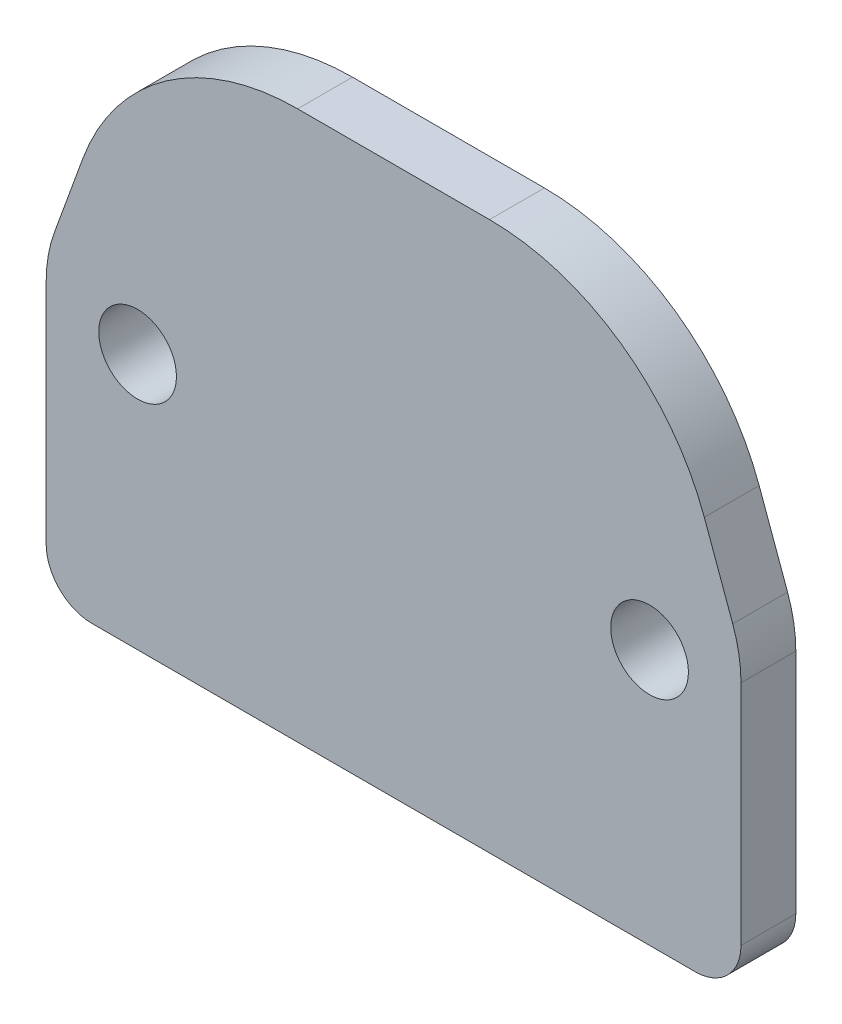
ISO-10303-21;
HEADER;
FILE_DESCRIPTION(('STEP AP214'),'2;1');
FILE_NAME('part.step','',(''),(''),'','','');
FILE_SCHEMA(('AUTOMOTIVE_DESIGN { 1 0 10303 214 1 1 1 1 }'));
ENDSEC;
DATA;
#1=APPLICATION_CONTEXT('core data for automotive mechanical design processes');
#2=APPLICATION_PROTOCOL_DEFINITION('international standard','automotive_design',2000,#1);
#3=PRODUCT_CONTEXT('',#1,'mechanical');
#4=PRODUCT('Part','Part','',(#3));
#5=PRODUCT_RELATED_PRODUCT_CATEGORY('part','',(#4));
#6=PRODUCT_DEFINITION_FORMATION('','',#4);
#7=PRODUCT_DEFINITION_CONTEXT('part definition',#1,'design');
#8=PRODUCT_DEFINITION('design','',#6,#7);
#9=PRODUCT_DEFINITION_SHAPE('','',#8);
#10=(LENGTH_UNIT() NAMED_UNIT(*) SI_UNIT(.MILLI.,.METRE.));
#11=(NAMED_UNIT(*) PLANE_ANGLE_UNIT() SI_UNIT($,.RADIAN.));
#12=(NAMED_UNIT(*) SI_UNIT($,.STERADIAN.) SOLID_ANGLE_UNIT());
#13=UNCERTAINTY_MEASURE_WITH_UNIT(LENGTH_MEASURE(1.E-05),#10,'distance_accuracy_value','');
#14=(GEOMETRIC_REPRESENTATION_CONTEXT(3) GLOBAL_UNCERTAINTY_ASSIGNED_CONTEXT((#13)) GLOBAL_UNIT_ASSIGNED_CONTEXT((#10,
#11,#12)) REPRESENTATION_CONTEXT('',''));
#15=CARTESIAN_POINT('',(0.,0.,0.));
#16=DIRECTION('',(0.,0.,1.));
#17=DIRECTION('',(1.,0.,0.));
#18=AXIS2_PLACEMENT_3D('',#15,#16,#17);
#19=CARTESIAN_POINT('',(33.,-55.,6.));
#20=DIRECTION('',(0.,0.,1.));
#21=DIRECTION('',(1.,0.,0.));
#22=AXIS2_PLACEMENT_3D('',#19,#20,#21);
#23=PLANE('',#22);
#24=CARTESIAN_POINT('',(-28.,-32.,6.));
#25=DIRECTION('',(0.,0.,1.));
#26=DIRECTION('',(1.,0.,0.));
#27=AXIS2_PLACEMENT_3D('',#24,#25,#26);
#28=CIRCLE('',#27,4.25);
#29=CARTESIAN_POINT('',(-23.75,-32.,6.));
#30=VERTEX_POINT('',#29);
#31=EDGE_CURVE('E170',#30,#30,#28,.T.);
#32=ORIENTED_EDGE('',*,*,#31,.F.);
#33=EDGE_LOOP('',(#32));
#34=FACE_BOUND('',#33,.T.);
#35=CARTESIAN_POINT('',(33.,-55.,6.));
#36=DIRECTION('',(0.,0.,1.));
#37=DIRECTION('',(1.,0.,0.));
#38=AXIS2_PLACEMENT_3D('',#35,#36,#37);
#39=CIRCLE('',#38,4.99999999999999);
#40=CARTESIAN_POINT('',(33.,-60.,6.));
#41=VERTEX_POINT('',#40);
#42=CARTESIAN_POINT('',(38.,-55.,6.));
#43=VERTEX_POINT('',#42);
#44=EDGE_CURVE('E189',#41,#43,#39,.T.);
#45=ORIENTED_EDGE('',*,*,#44,.T.);
#46=DIRECTION('',(0.,1.,0.));
#47=VECTOR('',#46,1.);
#48=CARTESIAN_POINT('',(38.,-55.,6.));
#49=LINE('',#48,#47);
#50=CARTESIAN_POINT('',(38.,-30.1196789051737,6.));
#51=VERTEX_POINT('',#50);
#52=EDGE_CURVE('E117',#43,#51,#49,.T.);
#53=ORIENTED_EDGE('',*,*,#52,.T.);
#54=CARTESIAN_POINT('',(23.,-30.1196789051736,6.));
#55=DIRECTION('',(0.,0.,1.));
#56=DIRECTION('',(1.,0.,0.));
#57=AXIS2_PLACEMENT_3D('',#54,#55,#56);
#58=CIRCLE('',#57,15.);
#59=CARTESIAN_POINT('',(37.0953893117887,-24.9893767552888,6.));
#60=VERTEX_POINT('',#59);
#61=EDGE_CURVE('E216',#51,#60,#58,.T.);
#62=ORIENTED_EDGE('',*,*,#61,.T.);
#63=DIRECTION('',(-0.342020143325664,0.93969262078591,0.));
#64=VECTOR('',#63,1.);
#65=CARTESIAN_POINT('',(37.0953893117887,-24.9893767552888,6.));
#66=LINE('',#65,#64);
#67=CARTESIAN_POINT('',(33.9871270644049,-16.4494964168584,6.));
#68=VERTEX_POINT('',#67);
#69=EDGE_CURVE('E235',#60,#68,#66,.T.);
#70=ORIENTED_EDGE('',*,*,#69,.T.);
#71=CARTESIAN_POINT('',(10.4948115447572,-25.,6.));
#72=DIRECTION('',(0.,0.,1.));
#73=DIRECTION('',(1.,0.,0.));
#74=AXIS2_PLACEMENT_3D('',#71,#72,#73);
#75=CIRCLE('',#74,25.);
#76=CARTESIAN_POINT('',(10.4948115447572,0.,6.));
#77=VERTEX_POINT('',#76);
#78=EDGE_CURVE('E232',#68,#77,#75,.T.);
#79=ORIENTED_EDGE('',*,*,#78,.T.);
#80=DIRECTION('',(-1.,0.,0.));
#81=VECTOR('',#80,1.);
#82=CARTESIAN_POINT('',(10.4948115447572,0.,6.));
#83=LINE('',#82,#81);
#84=CARTESIAN_POINT('',(-10.4948115447572,0.,6.));
#85=VERTEX_POINT('',#84);
#86=EDGE_CURVE('E234',#77,#85,#83,.T.);
#87=ORIENTED_EDGE('',*,*,#86,.T.);
#88=CARTESIAN_POINT('',(-10.4948115447572,-25.,6.));
#89=DIRECTION('',(0.,0.,1.));
#90=DIRECTION('',(1.,0.,0.));
#91=AXIS2_PLACEMENT_3D('',#88,#89,#90);
#92=CIRCLE('',#91,25.);
#93=CARTESIAN_POINT('',(-33.9871270644049,-16.4494964168584,6.));
#94=VERTEX_POINT('',#93);
#95=EDGE_CURVE('E237',#85,#94,#92,.T.);
#96=ORIENTED_EDGE('',*,*,#95,.T.);
#97=DIRECTION('',(-0.342020143325661,-0.939692620785911,0.));
#98=VECTOR('',#97,1.);
#99=CARTESIAN_POINT('',(-33.9871270644049,-16.4494964168584,6.));
#100=LINE('',#99,#98);
#101=CARTESIAN_POINT('',(-37.0953893117887,-24.9893767552888,6.));
#102=VERTEX_POINT('',#101);
#103=EDGE_CURVE('E243',#94,#102,#100,.T.);
#104=ORIENTED_EDGE('',*,*,#103,.T.);
#105=CARTESIAN_POINT('',(-23.,-30.1196789051736,6.));
#106=DIRECTION('',(0.,0.,1.));
#107=DIRECTION('',(1.,0.,0.));
#108=AXIS2_PLACEMENT_3D('',#105,#106,#107);
#109=CIRCLE('',#108,15.);
#110=CARTESIAN_POINT('',(-38.,-30.1196789051737,6.));
#111=VERTEX_POINT('',#110);
#112=EDGE_CURVE('E148',#102,#111,#109,.T.);
#113=ORIENTED_EDGE('',*,*,#112,.T.);
#114=DIRECTION('',(0.,-1.,0.));
#115=VECTOR('',#114,1.);
#116=CARTESIAN_POINT('',(-38.,-30.1196789051737,6.));
#117=LINE('',#116,#115);
#118=CARTESIAN_POINT('',(-38.,-55.,6.));
#119=VERTEX_POINT('',#118);
#120=EDGE_CURVE('E142',#111,#119,#117,.T.);
#121=ORIENTED_EDGE('',*,*,#120,.T.);
#122=CARTESIAN_POINT('',(-33.,-55.,6.));
#123=DIRECTION('',(0.,0.,1.));
#124=DIRECTION('',(1.,0.,0.));
#125=AXIS2_PLACEMENT_3D('',#122,#123,#124);
#126=CIRCLE('',#125,4.99999999999999);
#127=CARTESIAN_POINT('',(-33.,-60.,6.));
#128=VERTEX_POINT('',#127);
#129=EDGE_CURVE('E146',#119,#128,#126,.T.);
#130=ORIENTED_EDGE('',*,*,#129,.T.);
#131=DIRECTION('',(1.,0.,0.));
#132=VECTOR('',#131,1.);
#133=CARTESIAN_POINT('',(-33.,-60.,6.));
#134=LINE('',#133,#132);
#135=EDGE_CURVE('E62',#128,#41,#134,.T.);
#136=ORIENTED_EDGE('',*,*,#135,.T.);
#137=EDGE_LOOP('',(#45,#53,#62,#70,#79,#87,#96,#104,#113,#121,#130,#136));
#138=FACE_BOUND('',#137,.T.);
#139=CARTESIAN_POINT('',(28.,-32.,6.));
#140=DIRECTION('',(0.,0.,1.));
#141=DIRECTION('',(1.,0.,0.));
#142=AXIS2_PLACEMENT_3D('',#139,#140,#141);
#143=CIRCLE('',#142,4.25);
#144=CARTESIAN_POINT('',(32.25,-32.,6.));
#145=VERTEX_POINT('',#144);
#146=EDGE_CURVE('E286',#145,#145,#143,.T.);
#147=ORIENTED_EDGE('',*,*,#146,.F.);
#148=EDGE_LOOP('',(#147));
#149=FACE_BOUND('',#148,.T.);
#150=ADVANCED_FACE('F45',(#34,#138,#149),#23,.T.);
#151=CARTESIAN_POINT('',(33.,-55.,0.));
#152=DIRECTION('',(0.,0.,1.));
#153=DIRECTION('',(1.,0.,0.));
#154=AXIS2_PLACEMENT_3D('',#151,#152,#153);
#155=PLANE('',#154);
#156=CARTESIAN_POINT('',(-28.,-32.,0.));
#157=DIRECTION('',(0.,0.,1.));
#158=DIRECTION('',(1.,0.,0.));
#159=AXIS2_PLACEMENT_3D('',#156,#157,#158);
#160=CIRCLE('',#159,4.25);
#161=CARTESIAN_POINT('',(-23.75,-32.,0.));
#162=VERTEX_POINT('',#161);
#163=EDGE_CURVE('E291',#162,#162,#160,.T.);
#164=ORIENTED_EDGE('',*,*,#163,.T.);
#165=EDGE_LOOP('',(#164));
#166=FACE_BOUND('',#165,.T.);
#167=CARTESIAN_POINT('',(33.,-55.,0.));
#168=DIRECTION('',(0.,0.,1.));
#169=DIRECTION('',(1.,0.,0.));
#170=AXIS2_PLACEMENT_3D('',#167,#168,#169);
#171=CIRCLE('',#170,4.99999999999999);
#172=CARTESIAN_POINT('',(33.,-60.,0.));
#173=VERTEX_POINT('',#172);
#174=CARTESIAN_POINT('',(38.,-55.,0.));
#175=VERTEX_POINT('',#174);
#176=EDGE_CURVE('E166',#173,#175,#171,.T.);
#177=ORIENTED_EDGE('',*,*,#176,.F.);
#178=DIRECTION('',(1.,0.,0.));
#179=VECTOR('',#178,1.);
#180=CARTESIAN_POINT('',(-33.,-60.,0.));
#181=LINE('',#180,#179);
#182=CARTESIAN_POINT('',(-33.,-60.,0.));
#183=VERTEX_POINT('',#182);
#184=EDGE_CURVE('E109',#183,#173,#181,.T.);
#185=ORIENTED_EDGE('',*,*,#184,.F.);
#186=CARTESIAN_POINT('',(-33.,-55.,0.));
#187=DIRECTION('',(0.,0.,1.));
#188=DIRECTION('',(1.,0.,0.));
#189=AXIS2_PLACEMENT_3D('',#186,#187,#188);
#190=CIRCLE('',#189,4.99999999999999);
#191=CARTESIAN_POINT('',(-38.,-55.,0.));
#192=VERTEX_POINT('',#191);
#193=EDGE_CURVE('E103',#192,#183,#190,.T.);
#194=ORIENTED_EDGE('',*,*,#193,.F.);
#195=DIRECTION('',(0.,-1.,0.));
#196=VECTOR('',#195,1.);
#197=CARTESIAN_POINT('',(-38.,-30.1196789051737,0.));
#198=LINE('',#197,#196);
#199=CARTESIAN_POINT('',(-38.,-30.1196789051737,0.));
#200=VERTEX_POINT('',#199);
#201=EDGE_CURVE('E156',#200,#192,#198,.T.);
#202=ORIENTED_EDGE('',*,*,#201,.F.);
#203=CARTESIAN_POINT('',(-23.,-30.1196789051736,0.));
#204=DIRECTION('',(0.,0.,1.));
#205=DIRECTION('',(1.,0.,0.));
#206=AXIS2_PLACEMENT_3D('',#203,#204,#205);
#207=CIRCLE('',#206,15.);
#208=CARTESIAN_POINT('',(-37.0953893117887,-24.9893767552888,0.));
#209=VERTEX_POINT('',#208);
#210=EDGE_CURVE('E184',#209,#200,#207,.T.);
#211=ORIENTED_EDGE('',*,*,#210,.F.);
#212=DIRECTION('',(-0.342020143325661,-0.939692620785911,0.));
#213=VECTOR('',#212,1.);
#214=CARTESIAN_POINT('',(-33.9871270644049,-16.4494964168584,0.));
#215=LINE('',#214,#213);
#216=CARTESIAN_POINT('',(-33.9871270644049,-16.4494964168584,0.));
#217=VERTEX_POINT('',#216);
#218=EDGE_CURVE('E182',#217,#209,#215,.T.);
#219=ORIENTED_EDGE('',*,*,#218,.F.);
#220=CARTESIAN_POINT('',(-10.4948115447572,-25.,0.));
#221=DIRECTION('',(0.,0.,1.));
#222=DIRECTION('',(1.,0.,0.));
#223=AXIS2_PLACEMENT_3D('',#220,#221,#222);
#224=CIRCLE('',#223,25.);
#225=CARTESIAN_POINT('',(-10.4948115447572,0.,0.));
#226=VERTEX_POINT('',#225);
#227=EDGE_CURVE('E180',#226,#217,#224,.T.);
#228=ORIENTED_EDGE('',*,*,#227,.F.);
#229=DIRECTION('',(-1.,0.,0.));
#230=VECTOR('',#229,1.);
#231=CARTESIAN_POINT('',(10.4948115447572,0.,0.));
#232=LINE('',#231,#230);
#233=CARTESIAN_POINT('',(10.4948115447572,0.,0.));
#234=VERTEX_POINT('',#233);
#235=EDGE_CURVE('E178',#234,#226,#232,.T.);
#236=ORIENTED_EDGE('',*,*,#235,.F.);
#237=CARTESIAN_POINT('',(10.4948115447572,-25.,0.));
#238=DIRECTION('',(0.,0.,1.));
#239=DIRECTION('',(1.,0.,0.));
#240=AXIS2_PLACEMENT_3D('',#237,#238,#239);
#241=CIRCLE('',#240,25.);
#242=CARTESIAN_POINT('',(33.9871270644049,-16.4494964168584,0.));
#243=VERTEX_POINT('',#242);
#244=EDGE_CURVE('E176',#243,#234,#241,.T.);
#245=ORIENTED_EDGE('',*,*,#244,.F.);
#246=DIRECTION('',(-0.342020143325664,0.93969262078591,0.));
#247=VECTOR('',#246,1.);
#248=CARTESIAN_POINT('',(37.0953893117887,-24.9893767552888,0.));
#249=LINE('',#248,#247);
#250=CARTESIAN_POINT('',(37.0953893117887,-24.9893767552888,0.));
#251=VERTEX_POINT('',#250);
#252=EDGE_CURVE('E174',#251,#243,#249,.T.);
#253=ORIENTED_EDGE('',*,*,#252,.F.);
#254=CARTESIAN_POINT('',(23.,-30.1196789051736,0.));
#255=DIRECTION('',(0.,0.,1.));
#256=DIRECTION('',(1.,0.,0.));
#257=AXIS2_PLACEMENT_3D('',#254,#255,#256);
#258=CIRCLE('',#257,15.);
#259=CARTESIAN_POINT('',(38.,-30.1196789051737,0.));
#260=VERTEX_POINT('',#259);
#261=EDGE_CURVE('E172',#260,#251,#258,.T.);
#262=ORIENTED_EDGE('',*,*,#261,.F.);
#263=DIRECTION('',(0.,1.,0.));
#264=VECTOR('',#263,1.);
#265=CARTESIAN_POINT('',(38.,-55.,0.));
#266=LINE('',#265,#264);
#267=EDGE_CURVE('E169',#175,#260,#266,.T.);
#268=ORIENTED_EDGE('',*,*,#267,.F.);
#269=EDGE_LOOP('',(#177,#185,#194,#202,#211,#219,#228,#236,#245,#253,#262,#268));
#270=FACE_BOUND('',#269,.T.);
#271=CARTESIAN_POINT('',(28.,-32.,0.));
#272=DIRECTION('',(0.,0.,1.));
#273=DIRECTION('',(1.,0.,0.));
#274=AXIS2_PLACEMENT_3D('',#271,#272,#273);
#275=CIRCLE('',#274,4.25);
#276=CARTESIAN_POINT('',(32.25,-32.,0.));
#277=VERTEX_POINT('',#276);
#278=EDGE_CURVE('E289',#277,#277,#275,.T.);
#279=ORIENTED_EDGE('',*,*,#278,.T.);
#280=EDGE_LOOP('',(#279));
#281=FACE_BOUND('',#280,.T.);
#282=ADVANCED_FACE('F220',(#166,#270,#281),#155,.F.);
#283=CARTESIAN_POINT('',(33.,-55.,6.));
#284=DIRECTION('',(0.,0.,-1.));
#285=DIRECTION('',(-1.,0.,0.));
#286=AXIS2_PLACEMENT_3D('',#283,#284,#285);
#287=CYLINDRICAL_SURFACE('',#286,4.99999999999999);
#288=ORIENTED_EDGE('',*,*,#176,.T.);
#289=DIRECTION('',(0.,0.,-1.));
#290=VECTOR('',#289,1.);
#291=CARTESIAN_POINT('',(38.,-55.,6.));
#292=LINE('',#291,#290);
#293=EDGE_CURVE('E11',#43,#175,#292,.T.);
#294=ORIENTED_EDGE('',*,*,#293,.F.);
#295=ORIENTED_EDGE('',*,*,#44,.F.);
#296=DIRECTION('',(0.,0.,-1.));
#297=VECTOR('',#296,1.);
#298=CARTESIAN_POINT('',(33.,-60.,6.));
#299=LINE('',#298,#297);
#300=EDGE_CURVE('E162',#41,#173,#299,.T.);
#301=ORIENTED_EDGE('',*,*,#300,.T.);
#302=EDGE_LOOP('',(#288,#294,#295,#301));
#303=FACE_BOUND('',#302,.T.);
#304=ADVANCED_FACE('F47',(#303),#287,.T.);
#305=CARTESIAN_POINT('',(38.,-55.,6.));
#306=DIRECTION('',(-1.,0.,0.));
#307=DIRECTION('',(0.,-1.,0.));
#308=AXIS2_PLACEMENT_3D('',#305,#306,#307);
#309=PLANE('',#308);
#310=ORIENTED_EDGE('',*,*,#267,.T.);
#311=DIRECTION('',(0.,0.,-1.));
#312=VECTOR('',#311,1.);
#313=CARTESIAN_POINT('',(38.,-30.1196789051737,6.));
#314=LINE('',#313,#312);
#315=EDGE_CURVE('E54',#51,#260,#314,.T.);
#316=ORIENTED_EDGE('',*,*,#315,.F.);
#317=ORIENTED_EDGE('',*,*,#52,.F.);
#318=ORIENTED_EDGE('',*,*,#293,.T.);
#319=EDGE_LOOP('',(#310,#316,#317,#318));
#320=FACE_BOUND('',#319,.T.);
#321=ADVANCED_FACE('F364',(#320),#309,.F.);
#322=CARTESIAN_POINT('',(23.,-30.1196789051736,6.));
#323=DIRECTION('',(0.,0.,-1.));
#324=DIRECTION('',(-1.,0.,0.));
#325=AXIS2_PLACEMENT_3D('',#322,#323,#324);
#326=CYLINDRICAL_SURFACE('',#325,15.);
#327=ORIENTED_EDGE('',*,*,#261,.T.);
#328=DIRECTION('',(0.,0.,-1.));
#329=VECTOR('',#328,1.);
#330=CARTESIAN_POINT('',(37.0953893117887,-24.9893767552888,6.));
#331=LINE('',#330,#329);
#332=EDGE_CURVE('E208',#60,#251,#331,.T.);
#333=ORIENTED_EDGE('',*,*,#332,.F.);
#334=ORIENTED_EDGE('',*,*,#61,.F.);
#335=ORIENTED_EDGE('',*,*,#315,.T.);
#336=EDGE_LOOP('',(#327,#333,#334,#335));
#337=FACE_BOUND('',#336,.T.);
#338=ADVANCED_FACE('F214',(#337),#326,.T.);
#339=CARTESIAN_POINT('',(37.0953893117887,-24.9893767552888,6.));
#340=DIRECTION('',(-0.93969262078591,-0.342020143325664,0.));
#341=DIRECTION('',(0.342020143325664,-0.93969262078591,0.));
#342=AXIS2_PLACEMENT_3D('',#339,#340,#341);
#343=PLANE('',#342);
#344=ORIENTED_EDGE('',*,*,#252,.T.);
#345=DIRECTION('',(0.,0.,-1.));
#346=VECTOR('',#345,1.);
#347=CARTESIAN_POINT('',(33.9871270644049,-16.4494964168584,6.));
#348=LINE('',#347,#346);
#349=EDGE_CURVE('E205',#68,#243,#348,.T.);
#350=ORIENTED_EDGE('',*,*,#349,.F.);
#351=ORIENTED_EDGE('',*,*,#69,.F.);
#352=ORIENTED_EDGE('',*,*,#332,.T.);
#353=EDGE_LOOP('',(#344,#350,#351,#352));
#354=FACE_BOUND('',#353,.T.);
#355=ADVANCED_FACE('F226',(#354),#343,.F.);
#356=CARTESIAN_POINT('',(10.4948115447572,-25.,6.));
#357=DIRECTION('',(0.,0.,-1.));
#358=DIRECTION('',(-1.,0.,0.));
#359=AXIS2_PLACEMENT_3D('',#356,#357,#358);
#360=CYLINDRICAL_SURFACE('',#359,25.);
#361=ORIENTED_EDGE('',*,*,#244,.T.);
#362=DIRECTION('',(0.,0.,-1.));
#363=VECTOR('',#362,1.);
#364=CARTESIAN_POINT('',(10.4948115447572,0.,6.));
#365=LINE('',#364,#363);
#366=EDGE_CURVE('E202',#77,#234,#365,.T.);
#367=ORIENTED_EDGE('',*,*,#366,.F.);
#368=ORIENTED_EDGE('',*,*,#78,.F.);
#369=ORIENTED_EDGE('',*,*,#349,.T.);
#370=EDGE_LOOP('',(#361,#367,#368,#369));
#371=FACE_BOUND('',#370,.T.);
#372=ADVANCED_FACE('F230',(#371),#360,.T.);
#373=CARTESIAN_POINT('',(10.4948115447572,0.,6.));
#374=DIRECTION('',(0.,-1.,0.));
#375=DIRECTION('',(0.,0.,-1.));
#376=AXIS2_PLACEMENT_3D('',#373,#374,#375);
#377=PLANE('',#376);
#378=ORIENTED_EDGE('',*,*,#235,.T.);
#379=DIRECTION('',(0.,0.,-1.));
#380=VECTOR('',#379,1.);
#381=CARTESIAN_POINT('',(-10.4948115447572,0.,6.));
#382=LINE('',#381,#380);
#383=EDGE_CURVE('E199',#85,#226,#382,.T.);
#384=ORIENTED_EDGE('',*,*,#383,.F.);
#385=ORIENTED_EDGE('',*,*,#86,.F.);
#386=ORIENTED_EDGE('',*,*,#366,.T.);
#387=EDGE_LOOP('',(#378,#384,#385,#386));
#388=FACE_BOUND('',#387,.T.);
#389=ADVANCED_FACE('F337',(#388),#377,.F.);
#390=CARTESIAN_POINT('',(-10.4948115447572,-25.,6.));
#391=DIRECTION('',(0.,0.,-1.));
#392=DIRECTION('',(-1.,0.,0.));
#393=AXIS2_PLACEMENT_3D('',#390,#391,#392);
#394=CYLINDRICAL_SURFACE('',#393,25.);
#395=ORIENTED_EDGE('',*,*,#227,.T.);
#396=DIRECTION('',(0.,0.,-1.));
#397=VECTOR('',#396,1.);
#398=CARTESIAN_POINT('',(-33.9871270644049,-16.4494964168584,6.));
#399=LINE('',#398,#397);
#400=EDGE_CURVE('E196',#94,#217,#399,.T.);
#401=ORIENTED_EDGE('',*,*,#400,.F.);
#402=ORIENTED_EDGE('',*,*,#95,.F.);
#403=ORIENTED_EDGE('',*,*,#383,.T.);
#404=EDGE_LOOP('',(#395,#401,#402,#403));
#405=FACE_BOUND('',#404,.T.);
#406=ADVANCED_FACE('F330',(#405),#394,.T.);
#407=CARTESIAN_POINT('',(-33.9871270644049,-16.4494964168584,6.));
#408=DIRECTION('',(0.939692620785911,-0.342020143325661,0.));
#409=DIRECTION('',(0.342020143325661,0.939692620785911,0.));
#410=AXIS2_PLACEMENT_3D('',#407,#408,#409);
#411=PLANE('',#410);
#412=ORIENTED_EDGE('',*,*,#218,.T.);
#413=DIRECTION('',(0.,0.,-1.));
#414=VECTOR('',#413,1.);
#415=CARTESIAN_POINT('',(-37.0953893117887,-24.9893767552888,6.));
#416=LINE('',#415,#414);
#417=EDGE_CURVE('E193',#102,#209,#416,.T.);
#418=ORIENTED_EDGE('',*,*,#417,.F.);
#419=ORIENTED_EDGE('',*,*,#103,.F.);
#420=ORIENTED_EDGE('',*,*,#400,.T.);
#421=EDGE_LOOP('',(#412,#418,#419,#420));
#422=FACE_BOUND('',#421,.T.);
#423=ADVANCED_FACE('F249',(#422),#411,.F.);
#424=CARTESIAN_POINT('',(-23.,-30.1196789051736,6.));
#425=DIRECTION('',(0.,0.,-1.));
#426=DIRECTION('',(-1.,0.,0.));
#427=AXIS2_PLACEMENT_3D('',#424,#425,#426);
#428=CYLINDRICAL_SURFACE('',#427,15.);
#429=ORIENTED_EDGE('',*,*,#210,.T.);
#430=DIRECTION('',(0.,0.,-1.));
#431=VECTOR('',#430,1.);
#432=CARTESIAN_POINT('',(-38.,-30.1196789051737,6.));
#433=LINE('',#432,#431);
#434=EDGE_CURVE('E157',#111,#200,#433,.T.);
#435=ORIENTED_EDGE('',*,*,#434,.F.);
#436=ORIENTED_EDGE('',*,*,#112,.F.);
#437=ORIENTED_EDGE('',*,*,#417,.T.);
#438=EDGE_LOOP('',(#429,#435,#436,#437));
#439=FACE_BOUND('',#438,.T.);
#440=ADVANCED_FACE('F253',(#439),#428,.T.);
#441=CARTESIAN_POINT('',(-38.,-30.1196789051737,6.));
#442=DIRECTION('',(1.,0.,0.));
#443=DIRECTION('',(0.,0.,-1.));
#444=AXIS2_PLACEMENT_3D('',#441,#442,#443);
#445=PLANE('',#444);
#446=ORIENTED_EDGE('',*,*,#201,.T.);
#447=DIRECTION('',(0.,0.,-1.));
#448=VECTOR('',#447,1.);
#449=CARTESIAN_POINT('',(-38.,-55.,6.));
#450=LINE('',#449,#448);
#451=EDGE_CURVE('E153',#119,#192,#450,.T.);
#452=ORIENTED_EDGE('',*,*,#451,.F.);
#453=ORIENTED_EDGE('',*,*,#120,.F.);
#454=ORIENTED_EDGE('',*,*,#434,.T.);
#455=EDGE_LOOP('',(#446,#452,#453,#454));
#456=FACE_BOUND('',#455,.T.);
#457=ADVANCED_FACE('F154',(#456),#445,.F.);
#458=CARTESIAN_POINT('',(-33.,-55.,6.));
#459=DIRECTION('',(0.,0.,-1.));
#460=DIRECTION('',(-1.,0.,0.));
#461=AXIS2_PLACEMENT_3D('',#458,#459,#460);
#462=CYLINDRICAL_SURFACE('',#461,4.99999999999999);
#463=ORIENTED_EDGE('',*,*,#193,.T.);
#464=DIRECTION('',(0.,0.,-1.));
#465=VECTOR('',#464,1.);
#466=CARTESIAN_POINT('',(-33.,-60.,6.));
#467=LINE('',#466,#465);
#468=EDGE_CURVE('E158',#128,#183,#467,.T.);
#469=ORIENTED_EDGE('',*,*,#468,.F.);
#470=ORIENTED_EDGE('',*,*,#129,.F.);
#471=ORIENTED_EDGE('',*,*,#451,.T.);
#472=EDGE_LOOP('',(#463,#469,#470,#471));
#473=FACE_BOUND('',#472,.T.);
#474=ADVANCED_FACE('F160',(#473),#462,.T.);
#475=CARTESIAN_POINT('',(-33.,-60.,6.));
#476=DIRECTION('',(0.,1.,0.));
#477=DIRECTION('',(-1.,0.,0.));
#478=AXIS2_PLACEMENT_3D('',#475,#476,#477);
#479=PLANE('',#478);
#480=ORIENTED_EDGE('',*,*,#184,.T.);
#481=ORIENTED_EDGE('',*,*,#300,.F.);
#482=ORIENTED_EDGE('',*,*,#135,.F.);
#483=ORIENTED_EDGE('',*,*,#468,.T.);
#484=EDGE_LOOP('',(#480,#481,#482,#483));
#485=FACE_BOUND('',#484,.T.);
#486=ADVANCED_FACE('F257',(#485),#479,.F.);
#487=CARTESIAN_POINT('',(-28.,-32.,6.));
#488=DIRECTION('',(0.,0.,-1.));
#489=DIRECTION('',(-1.,0.,0.));
#490=AXIS2_PLACEMENT_3D('',#487,#488,#489);
#491=CYLINDRICAL_SURFACE('',#490,4.25);
#492=ORIENTED_EDGE('',*,*,#31,.T.);
#493=EDGE_LOOP('',(#492));
#494=FACE_BOUND('',#493,.T.);
#495=ORIENTED_EDGE('',*,*,#163,.F.);
#496=EDGE_LOOP('',(#495));
#497=FACE_BOUND('',#496,.T.);
#498=ADVANCED_FACE('F259',(#494,#497),#491,.F.);
#499=CARTESIAN_POINT('',(28.,-32.,6.));
#500=DIRECTION('',(0.,0.,-1.));
#501=DIRECTION('',(-1.,0.,0.));
#502=AXIS2_PLACEMENT_3D('',#499,#500,#501);
#503=CYLINDRICAL_SURFACE('',#502,4.25);
#504=ORIENTED_EDGE('',*,*,#146,.T.);
#505=EDGE_LOOP('',(#504));
#506=FACE_BOUND('',#505,.T.);
#507=ORIENTED_EDGE('',*,*,#278,.F.);
#508=EDGE_LOOP('',(#507));
#509=FACE_BOUND('',#508,.T.);
#510=ADVANCED_FACE('F265',(#506,#509),#503,.F.);
#511=CLOSED_SHELL('',(#150,#282,#304,#321,#338,#355,#372,#389,#406,#423,#440,#457,#474,#486,
#498,#510));
#512=MANIFOLD_SOLID_BREP('B2',#511);
#513=ADVANCED_BREP_SHAPE_REPRESENTATION('',(#18,#512),#14);
#514=SHAPE_DEFINITION_REPRESENTATION(#9,#513);
ENDSEC;
END-ISO-10303-21;
